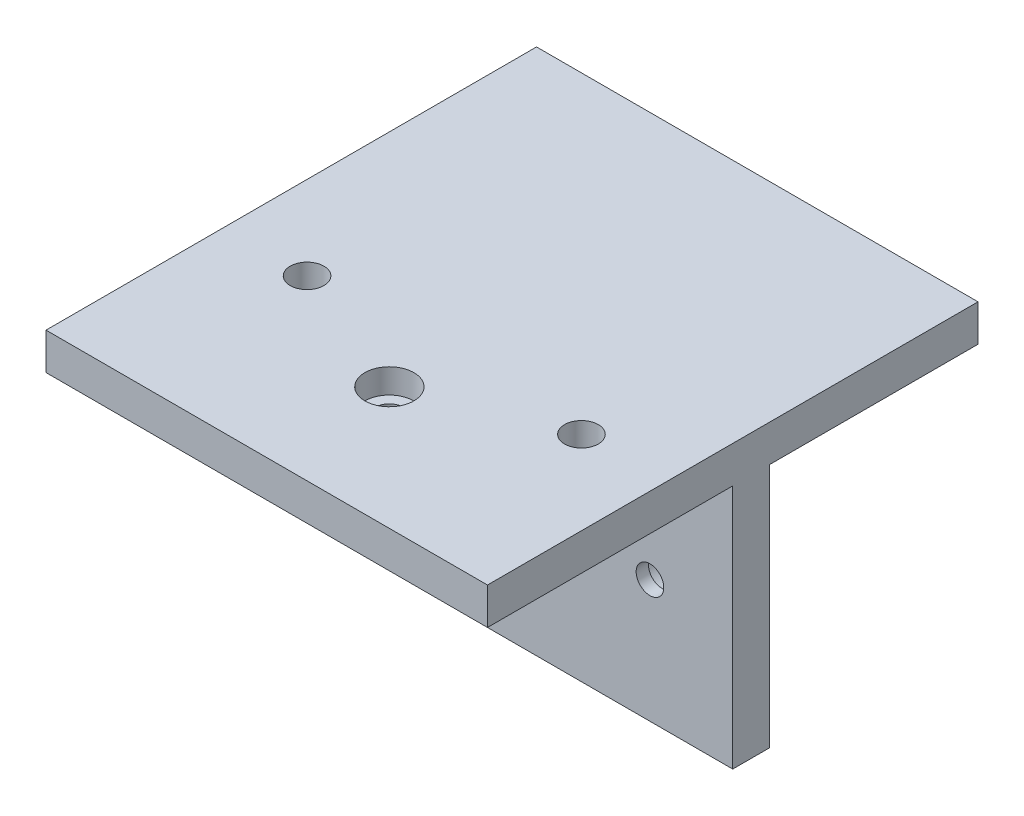
ISO-10303-21;
HEADER;
FILE_DESCRIPTION(('STEP AP214'),'2;1');
FILE_NAME('part.step','',(''),(''),'','','');
FILE_SCHEMA(('AUTOMOTIVE_DESIGN { 1 0 10303 214 1 1 1 1 }'));
ENDSEC;
DATA;
#1=APPLICATION_CONTEXT('core data for automotive mechanical design processes');
#2=APPLICATION_PROTOCOL_DEFINITION('international standard','automotive_design',2000,#1);
#3=PRODUCT_CONTEXT('',#1,'mechanical');
#4=PRODUCT('Part','Part','',(#3));
#5=PRODUCT_RELATED_PRODUCT_CATEGORY('part','',(#4));
#6=PRODUCT_DEFINITION_FORMATION('','',#4);
#7=PRODUCT_DEFINITION_CONTEXT('part definition',#1,'design');
#8=PRODUCT_DEFINITION('design','',#6,#7);
#9=PRODUCT_DEFINITION_SHAPE('','',#8);
#10=(LENGTH_UNIT() NAMED_UNIT(*) SI_UNIT(.MILLI.,.METRE.));
#11=(NAMED_UNIT(*) PLANE_ANGLE_UNIT() SI_UNIT($,.RADIAN.));
#12=(NAMED_UNIT(*) SI_UNIT($,.STERADIAN.) SOLID_ANGLE_UNIT());
#13=UNCERTAINTY_MEASURE_WITH_UNIT(LENGTH_MEASURE(1.E-05),#10,'distance_accuracy_value','');
#14=(GEOMETRIC_REPRESENTATION_CONTEXT(3) GLOBAL_UNCERTAINTY_ASSIGNED_CONTEXT((#13)) GLOBAL_UNIT_ASSIGNED_CONTEXT((#10,
#11,#12)) REPRESENTATION_CONTEXT('',''));
#15=CARTESIAN_POINT('',(0.,0.,0.));
#16=DIRECTION('',(0.,0.,1.));
#17=DIRECTION('',(1.,0.,0.));
#18=AXIS2_PLACEMENT_3D('',#15,#16,#17);
#19=CARTESIAN_POINT('',(36.,0.,-26.));
#20=DIRECTION('',(0.,0.,1.));
#21=DIRECTION('',(1.,0.,0.));
#22=AXIS2_PLACEMENT_3D('',#19,#20,#21);
#23=PLANE('',#22);
#24=CARTESIAN_POINT('',(22.5,0.,-26.));
#25=DIRECTION('',(0.,0.,-1.));
#26=DIRECTION('',(-1.,0.,0.));
#27=AXIS2_PLACEMENT_3D('',#24,#25,#26);
#28=CIRCLE('',#27,4.);
#29=CARTESIAN_POINT('',(18.5,0.,-26.));
#30=VERTEX_POINT('',#29);
#31=EDGE_CURVE('E276',#30,#30,#28,.T.);
#32=ORIENTED_EDGE('',*,*,#31,.F.);
#33=EDGE_LOOP('',(#32));
#34=FACE_BOUND('',#33,.T.);
#35=DIRECTION('',(0.,-1.,0.));
#36=VECTOR('',#35,1.);
#37=CARTESIAN_POINT('',(3.,-20.,-26.));
#38=LINE('',#37,#36);
#39=CARTESIAN_POINT('',(3.,20.,-26.));
#40=VERTEX_POINT('',#39);
#41=CARTESIAN_POINT('',(3.,-20.,-26.));
#42=VERTEX_POINT('',#41);
#43=EDGE_CURVE('E325',#40,#42,#38,.T.);
#44=ORIENTED_EDGE('',*,*,#43,.F.);
#45=DIRECTION('',(-1.,0.,0.));
#46=VECTOR('',#45,1.);
#47=CARTESIAN_POINT('',(36.,20.,-26.));
#48=LINE('',#47,#46);
#49=CARTESIAN_POINT('',(36.,20.,-26.));
#50=VERTEX_POINT('',#49);
#51=EDGE_CURVE('E210',#50,#40,#48,.T.);
#52=ORIENTED_EDGE('',*,*,#51,.F.);
#53=DIRECTION('',(0.,1.,0.));
#54=VECTOR('',#53,1.);
#55=CARTESIAN_POINT('',(36.,0.,-26.));
#56=LINE('',#55,#54);
#57=CARTESIAN_POINT('',(36.,-20.,-26.));
#58=VERTEX_POINT('',#57);
#59=EDGE_CURVE('E115',#58,#50,#56,.T.);
#60=ORIENTED_EDGE('',*,*,#59,.F.);
#61=DIRECTION('',(-1.,0.,0.));
#62=VECTOR('',#61,1.);
#63=CARTESIAN_POINT('',(36.,-20.,-26.));
#64=LINE('',#63,#62);
#65=EDGE_CURVE('E11',#58,#42,#64,.T.);
#66=ORIENTED_EDGE('',*,*,#65,.T.);
#67=EDGE_LOOP('',(#44,#52,#60,#66));
#68=FACE_BOUND('',#67,.T.);
#69=ADVANCED_FACE('F47',(#34,#68),#23,.F.);
#70=CARTESIAN_POINT('',(36.,20.,0.));
#71=DIRECTION('',(0.,1.,0.));
#72=DIRECTION('',(0.,0.,1.));
#73=AXIS2_PLACEMENT_3D('',#70,#71,#72);
#74=PLANE('',#73);
#75=DIRECTION('',(0.,0.,1.));
#76=VECTOR('',#75,1.);
#77=CARTESIAN_POINT('',(3.,20.,-26.));
#78=LINE('',#77,#76);
#79=CARTESIAN_POINT('',(3.,20.,-60.));
#80=VERTEX_POINT('',#79);
#81=EDGE_CURVE('E330',#80,#40,#78,.T.);
#82=ORIENTED_EDGE('',*,*,#81,.F.);
#83=DIRECTION('',(-1.,0.,0.));
#84=VECTOR('',#83,1.);
#85=CARTESIAN_POINT('',(36.,20.,-60.));
#86=LINE('',#85,#84);
#87=CARTESIAN_POINT('',(36.,20.,-60.));
#88=VERTEX_POINT('',#87);
#89=EDGE_CURVE('E205',#88,#80,#86,.T.);
#90=ORIENTED_EDGE('',*,*,#89,.F.);
#91=DIRECTION('',(0.,0.,-1.));
#92=VECTOR('',#91,1.);
#93=CARTESIAN_POINT('',(36.,20.,0.));
#94=LINE('',#93,#92);
#95=EDGE_CURVE('E301',#50,#88,#94,.T.);
#96=ORIENTED_EDGE('',*,*,#95,.F.);
#97=ORIENTED_EDGE('',*,*,#51,.T.);
#98=EDGE_LOOP('',(#82,#90,#96,#97));
#99=FACE_BOUND('',#98,.T.);
#100=ADVANCED_FACE('F328',(#99),#74,.F.);
#101=CARTESIAN_POINT('',(22.375,-20.001,-8.95));
#102=DIRECTION('',(0.,1.,0.));
#103=DIRECTION('',(0.,0.,1.));
#104=AXIS2_PLACEMENT_3D('',#101,#102,#103);
#105=CYLINDRICAL_SURFACE('',#104,2.25);
#106=CARTESIAN_POINT('',(22.375,20.,-8.95));
#107=DIRECTION('',(0.,1.,0.));
#108=DIRECTION('',(0.,0.,1.));
#109=AXIS2_PLACEMENT_3D('',#106,#107,#108);
#110=CIRCLE('',#109,2.25);
#111=CARTESIAN_POINT('',(22.375,20.,-6.7));
#112=VERTEX_POINT('',#111);
#113=EDGE_CURVE('E238',#112,#112,#110,.F.);
#114=ORIENTED_EDGE('',*,*,#113,.T.);
#115=EDGE_LOOP('',(#114));
#116=FACE_BOUND('',#115,.T.);
#117=CARTESIAN_POINT('',(22.375,22.,-8.95));
#118=DIRECTION('',(0.,1.,0.));
#119=DIRECTION('',(0.,0.,1.));
#120=AXIS2_PLACEMENT_3D('',#117,#118,#119);
#121=CIRCLE('',#120,2.25);
#122=CARTESIAN_POINT('',(22.375,22.,-6.7));
#123=VERTEX_POINT('',#122);
#124=EDGE_CURVE('E51',#123,#123,#121,.F.);
#125=ORIENTED_EDGE('',*,*,#124,.F.);
#126=EDGE_LOOP('',(#125));
#127=FACE_BOUND('',#126,.T.);
#128=ADVANCED_FACE('F383',(#116,#127),#105,.F.);
#129=CARTESIAN_POINT('',(-22.375,-20.001,-8.95));
#130=DIRECTION('',(0.,1.,0.));
#131=DIRECTION('',(0.,0.,1.));
#132=AXIS2_PLACEMENT_3D('',#129,#130,#131);
#133=CYLINDRICAL_SURFACE('',#132,2.25);
#134=CARTESIAN_POINT('',(-22.375,20.,-8.95));
#135=DIRECTION('',(0.,1.,0.));
#136=DIRECTION('',(0.,0.,1.));
#137=AXIS2_PLACEMENT_3D('',#134,#135,#136);
#138=CIRCLE('',#137,2.25);
#139=CARTESIAN_POINT('',(-22.375,20.,-6.7));
#140=VERTEX_POINT('',#139);
#141=EDGE_CURVE('E259',#140,#140,#138,.F.);
#142=ORIENTED_EDGE('',*,*,#141,.T.);
#143=EDGE_LOOP('',(#142));
#144=FACE_BOUND('',#143,.T.);
#145=CARTESIAN_POINT('',(-22.375,22.,-8.95));
#146=DIRECTION('',(0.,1.,0.));
#147=DIRECTION('',(0.,0.,1.));
#148=AXIS2_PLACEMENT_3D('',#145,#146,#147);
#149=CIRCLE('',#148,2.25);
#150=CARTESIAN_POINT('',(-22.375,22.,-6.7));
#151=VERTEX_POINT('',#150);
#152=EDGE_CURVE('E229',#151,#151,#149,.F.);
#153=ORIENTED_EDGE('',*,*,#152,.F.);
#154=EDGE_LOOP('',(#153));
#155=FACE_BOUND('',#154,.T.);
#156=ADVANCED_FACE('F420',(#144,#155),#133,.F.);
#157=CARTESIAN_POINT('',(0.,26.001,0.));
#158=DIRECTION('',(0.,-1.,0.));
#159=DIRECTION('',(0.,0.,-1.));
#160=AXIS2_PLACEMENT_3D('',#157,#158,#159);
#161=CYLINDRICAL_SURFACE('',#160,2.25);
#162=CARTESIAN_POINT('',(0.,20.,0.));
#163=DIRECTION('',(0.,-1.,0.));
#164=DIRECTION('',(0.,0.,-1.));
#165=AXIS2_PLACEMENT_3D('',#162,#163,#164);
#166=CIRCLE('',#165,2.25);
#167=CARTESIAN_POINT('',(0.,20.,-2.25));
#168=VERTEX_POINT('',#167);
#169=EDGE_CURVE('E223',#168,#168,#166,.T.);
#170=ORIENTED_EDGE('',*,*,#169,.T.);
#171=EDGE_LOOP('',(#170));
#172=FACE_BOUND('',#171,.T.);
#173=CARTESIAN_POINT('',(0.,22.,0.));
#174=DIRECTION('',(0.,1.,0.));
#175=DIRECTION('',(0.,0.,1.));
#176=AXIS2_PLACEMENT_3D('',#173,#174,#175);
#177=CIRCLE('',#176,2.25);
#178=CARTESIAN_POINT('',(0.,22.,2.25));
#179=VERTEX_POINT('',#178);
#180=EDGE_CURVE('E224',#179,#179,#177,.F.);
#181=ORIENTED_EDGE('',*,*,#180,.F.);
#182=EDGE_LOOP('',(#181));
#183=FACE_BOUND('',#182,.T.);
#184=ADVANCED_FACE('F417',(#172,#183),#161,.F.);
#185=CARTESIAN_POINT('',(-22.5,0.,20.001));
#186=DIRECTION('',(0.,0.,-1.));
#187=DIRECTION('',(-1.,0.,0.));
#188=AXIS2_PLACEMENT_3D('',#185,#186,#187);
#189=CYLINDRICAL_SURFACE('',#188,2.25);
#190=CARTESIAN_POINT('',(-22.5,0.,-20.));
#191=DIRECTION('',(0.,0.,-1.));
#192=DIRECTION('',(0.,1.,0.));
#193=AXIS2_PLACEMENT_3D('',#190,#191,#192);
#194=CIRCLE('',#193,2.25);
#195=CARTESIAN_POINT('',(-22.5,2.25,-20.));
#196=VERTEX_POINT('',#195);
#197=EDGE_CURVE('E290',#196,#196,#194,.F.);
#198=ORIENTED_EDGE('',*,*,#197,.T.);
#199=EDGE_LOOP('',(#198));
#200=FACE_BOUND('',#199,.T.);
#201=CARTESIAN_POINT('',(-22.5,0.,-22.));
#202=DIRECTION('',(0.,0.,-1.));
#203=DIRECTION('',(-1.,0.,0.));
#204=AXIS2_PLACEMENT_3D('',#201,#202,#203);
#205=CIRCLE('',#204,2.25);
#206=CARTESIAN_POINT('',(-24.75,0.,-22.));
#207=VERTEX_POINT('',#206);
#208=EDGE_CURVE('E218',#207,#207,#205,.F.);
#209=ORIENTED_EDGE('',*,*,#208,.F.);
#210=EDGE_LOOP('',(#209));
#211=FACE_BOUND('',#210,.T.);
#212=ADVANCED_FACE('F419',(#200,#211),#189,.F.);
#213=CARTESIAN_POINT('',(22.5,0.,20.001));
#214=DIRECTION('',(0.,0.,-1.));
#215=DIRECTION('',(-1.,0.,0.));
#216=AXIS2_PLACEMENT_3D('',#213,#214,#215);
#217=CYLINDRICAL_SURFACE('',#216,2.25);
#218=CARTESIAN_POINT('',(22.5,0.,-20.));
#219=DIRECTION('',(0.,0.,-1.));
#220=DIRECTION('',(0.,1.,0.));
#221=AXIS2_PLACEMENT_3D('',#218,#219,#220);
#222=CIRCLE('',#221,2.25);
#223=CARTESIAN_POINT('',(22.5,2.25,-20.));
#224=VERTEX_POINT('',#223);
#225=EDGE_CURVE('E171',#224,#224,#222,.F.);
#226=ORIENTED_EDGE('',*,*,#225,.T.);
#227=EDGE_LOOP('',(#226));
#228=FACE_BOUND('',#227,.T.);
#229=CARTESIAN_POINT('',(22.5,0.,-22.));
#230=DIRECTION('',(0.,0.,-1.));
#231=DIRECTION('',(-1.,0.,0.));
#232=AXIS2_PLACEMENT_3D('',#229,#230,#231);
#233=CIRCLE('',#232,2.25);
#234=CARTESIAN_POINT('',(20.25,0.,-22.));
#235=VERTEX_POINT('',#234);
#236=EDGE_CURVE('E214',#235,#235,#233,.F.);
#237=ORIENTED_EDGE('',*,*,#236,.F.);
#238=EDGE_LOOP('',(#237));
#239=FACE_BOUND('',#238,.T.);
#240=ADVANCED_FACE('F393',(#228,#239),#217,.F.);
#241=CARTESIAN_POINT('',(36.,-20.,0.));
#242=DIRECTION('',(0.,1.,0.));
#243=DIRECTION('',(0.,0.,1.));
#244=AXIS2_PLACEMENT_3D('',#241,#242,#243);
#245=PLANE('',#244);
#246=DIRECTION('',(0.,0.,-1.));
#247=VECTOR('',#246,1.);
#248=CARTESIAN_POINT('',(-36.,-20.,0.));
#249=LINE('',#248,#247);
#250=CARTESIAN_POINT('',(-36.,-20.,-20.));
#251=VERTEX_POINT('',#250);
#252=CARTESIAN_POINT('',(-36.,-20.,-26.));
#253=VERTEX_POINT('',#252);
#254=EDGE_CURVE('E166',#251,#253,#249,.T.);
#255=ORIENTED_EDGE('',*,*,#254,.T.);
#256=CARTESIAN_POINT('',(-3.,-20.,-26.));
#257=VERTEX_POINT('',#256);
#258=EDGE_CURVE('E57',#257,#253,#64,.T.);
#259=ORIENTED_EDGE('',*,*,#258,.F.);
#260=DIRECTION('',(-1.,0.,0.));
#261=VECTOR('',#260,1.);
#262=CARTESIAN_POINT('',(3.,-20.,-26.));
#263=LINE('',#262,#261);
#264=EDGE_CURVE('E249',#42,#257,#263,.T.);
#265=ORIENTED_EDGE('',*,*,#264,.F.);
#266=ORIENTED_EDGE('',*,*,#65,.F.);
#267=DIRECTION('',(0.,0.,-1.));
#268=VECTOR('',#267,1.);
#269=CARTESIAN_POINT('',(36.,-20.,0.));
#270=LINE('',#269,#268);
#271=CARTESIAN_POINT('',(36.,-20.,-20.));
#272=VERTEX_POINT('',#271);
#273=EDGE_CURVE('E194',#272,#58,#270,.T.);
#274=ORIENTED_EDGE('',*,*,#273,.F.);
#275=DIRECTION('',(-1.,0.,0.));
#276=VECTOR('',#275,1.);
#277=CARTESIAN_POINT('',(36.,-20.,-20.));
#278=LINE('',#277,#276);
#279=EDGE_CURVE('E165',#272,#251,#278,.T.);
#280=ORIENTED_EDGE('',*,*,#279,.T.);
#281=EDGE_LOOP('',(#255,#259,#265,#266,#274,#280));
#282=FACE_BOUND('',#281,.T.);
#283=ADVANCED_FACE('F49',(#282),#245,.F.);
#284=CARTESIAN_POINT('',(-22.5,0.,-26.));
#285=DIRECTION('',(0.,0.,-1.));
#286=DIRECTION('',(-1.,0.,0.));
#287=AXIS2_PLACEMENT_3D('',#284,#285,#286);
#288=CIRCLE('',#287,4.);
#289=CARTESIAN_POINT('',(-26.5,0.,-26.));
#290=VERTEX_POINT('',#289);
#291=EDGE_CURVE('E280',#290,#290,#288,.T.);
#292=ORIENTED_EDGE('',*,*,#291,.F.);
#293=EDGE_LOOP('',(#292));
#294=FACE_BOUND('',#293,.T.);
#295=CARTESIAN_POINT('',(-3.,20.,-26.));
#296=VERTEX_POINT('',#295);
#297=CARTESIAN_POINT('',(-36.,20.,-26.));
#298=VERTEX_POINT('',#297);
#299=EDGE_CURVE('E209',#296,#298,#48,.T.);
#300=ORIENTED_EDGE('',*,*,#299,.F.);
#301=DIRECTION('',(0.,-1.,0.));
#302=VECTOR('',#301,1.);
#303=CARTESIAN_POINT('',(-3.,-20.,-26.));
#304=LINE('',#303,#302);
#305=EDGE_CURVE('E344',#296,#257,#304,.T.);
#306=ORIENTED_EDGE('',*,*,#305,.T.);
#307=ORIENTED_EDGE('',*,*,#258,.T.);
#308=DIRECTION('',(0.,1.,0.));
#309=VECTOR('',#308,1.);
#310=CARTESIAN_POINT('',(-36.,0.,-26.));
#311=LINE('',#310,#309);
#312=EDGE_CURVE('E170',#253,#298,#311,.T.);
#313=ORIENTED_EDGE('',*,*,#312,.T.);
#314=EDGE_LOOP('',(#300,#306,#307,#313));
#315=FACE_BOUND('',#314,.T.);
#316=ADVANCED_FACE('F367',(#294,#315),#23,.F.);
#317=CARTESIAN_POINT('',(-3.,20.,-60.));
#318=VERTEX_POINT('',#317);
#319=CARTESIAN_POINT('',(-36.,20.,-60.));
#320=VERTEX_POINT('',#319);
#321=EDGE_CURVE('E204',#318,#320,#86,.T.);
#322=ORIENTED_EDGE('',*,*,#321,.F.);
#323=DIRECTION('',(0.,0.,1.));
#324=VECTOR('',#323,1.);
#325=CARTESIAN_POINT('',(-3.,20.,-26.));
#326=LINE('',#325,#324);
#327=EDGE_CURVE('E65',#318,#296,#326,.T.);
#328=ORIENTED_EDGE('',*,*,#327,.T.);
#329=ORIENTED_EDGE('',*,*,#299,.T.);
#330=DIRECTION('',(0.,0.,-1.));
#331=VECTOR('',#330,1.);
#332=CARTESIAN_POINT('',(-36.,20.,0.));
#333=LINE('',#332,#331);
#334=EDGE_CURVE('E175',#298,#320,#333,.T.);
#335=ORIENTED_EDGE('',*,*,#334,.T.);
#336=EDGE_LOOP('',(#322,#328,#329,#335));
#337=FACE_BOUND('',#336,.T.);
#338=ADVANCED_FACE('F385',(#337),#74,.F.);
#339=CARTESIAN_POINT('',(36.,0.,-60.));
#340=DIRECTION('',(0.,0.,-1.));
#341=DIRECTION('',(-1.,0.,0.));
#342=AXIS2_PLACEMENT_3D('',#339,#340,#341);
#343=PLANE('',#342);
#344=DIRECTION('',(0.,-1.,0.));
#345=VECTOR('',#344,1.);
#346=CARTESIAN_POINT('',(-36.,0.,-60.));
#347=LINE('',#346,#345);
#348=CARTESIAN_POINT('',(-36.,26.,-60.));
#349=VERTEX_POINT('',#348);
#350=EDGE_CURVE('E179',#349,#320,#347,.T.);
#351=ORIENTED_EDGE('',*,*,#350,.F.);
#352=DIRECTION('',(-1.,0.,0.));
#353=VECTOR('',#352,1.);
#354=CARTESIAN_POINT('',(36.,26.,-60.));
#355=LINE('',#354,#353);
#356=CARTESIAN_POINT('',(36.,26.,-60.));
#357=VERTEX_POINT('',#356);
#358=EDGE_CURVE('E201',#357,#349,#355,.T.);
#359=ORIENTED_EDGE('',*,*,#358,.F.);
#360=DIRECTION('',(0.,-1.,0.));
#361=VECTOR('',#360,1.);
#362=CARTESIAN_POINT('',(36.,0.,-60.));
#363=LINE('',#362,#361);
#364=EDGE_CURVE('E159',#357,#88,#363,.T.);
#365=ORIENTED_EDGE('',*,*,#364,.T.);
#366=ORIENTED_EDGE('',*,*,#89,.T.);
#367=DIRECTION('',(-1.,0.,0.));
#368=VECTOR('',#367,1.);
#369=CARTESIAN_POINT('',(3.,20.,-60.));
#370=LINE('',#369,#368);
#371=EDGE_CURVE('E336',#80,#318,#370,.T.);
#372=ORIENTED_EDGE('',*,*,#371,.T.);
#373=ORIENTED_EDGE('',*,*,#321,.T.);
#374=EDGE_LOOP('',(#351,#359,#365,#366,#372,#373));
#375=FACE_BOUND('',#374,.T.);
#376=ADVANCED_FACE('F307',(#375),#343,.T.);
#377=CARTESIAN_POINT('',(36.,26.,0.));
#378=DIRECTION('',(0.,1.,0.));
#379=DIRECTION('',(0.,0.,1.));
#380=AXIS2_PLACEMENT_3D('',#377,#378,#379);
#381=PLANE('',#380);
#382=CARTESIAN_POINT('',(-22.375,26.,-8.95));
#383=DIRECTION('',(0.,1.,0.));
#384=DIRECTION('',(0.,0.,1.));
#385=AXIS2_PLACEMENT_3D('',#382,#383,#384);
#386=CIRCLE('',#385,2.75);
#387=CARTESIAN_POINT('',(-22.375,26.,-6.2));
#388=VERTEX_POINT('',#387);
#389=EDGE_CURVE('E240',#388,#388,#386,.T.);
#390=ORIENTED_EDGE('',*,*,#389,.F.);
#391=EDGE_LOOP('',(#390));
#392=FACE_BOUND('',#391,.T.);
#393=CARTESIAN_POINT('',(22.375,26.,-8.95));
#394=DIRECTION('',(0.,1.,0.));
#395=DIRECTION('',(0.,0.,1.));
#396=AXIS2_PLACEMENT_3D('',#393,#394,#395);
#397=CIRCLE('',#396,2.75);
#398=CARTESIAN_POINT('',(22.375,26.,-6.2));
#399=VERTEX_POINT('',#398);
#400=EDGE_CURVE('E246',#399,#399,#397,.T.);
#401=ORIENTED_EDGE('',*,*,#400,.F.);
#402=EDGE_LOOP('',(#401));
#403=FACE_BOUND('',#402,.T.);
#404=CARTESIAN_POINT('',(0.,26.,0.));
#405=DIRECTION('',(0.,1.,0.));
#406=DIRECTION('',(0.,0.,1.));
#407=AXIS2_PLACEMENT_3D('',#404,#405,#406);
#408=CIRCLE('',#407,4.);
#409=CARTESIAN_POINT('',(0.,26.,4.));
#410=VERTEX_POINT('',#409);
#411=EDGE_CURVE('E263',#410,#410,#408,.T.);
#412=ORIENTED_EDGE('',*,*,#411,.F.);
#413=EDGE_LOOP('',(#412));
#414=FACE_BOUND('',#413,.T.);
#415=DIRECTION('',(0.,0.,-1.));
#416=VECTOR('',#415,1.);
#417=CARTESIAN_POINT('',(-36.,26.,0.));
#418=LINE('',#417,#416);
#419=CARTESIAN_POINT('',(-36.,26.,20.));
#420=VERTEX_POINT('',#419);
#421=EDGE_CURVE('E183',#420,#349,#418,.T.);
#422=ORIENTED_EDGE('',*,*,#421,.F.);
#423=DIRECTION('',(-1.,0.,0.));
#424=VECTOR('',#423,1.);
#425=CARTESIAN_POINT('',(36.,26.,20.));
#426=LINE('',#425,#424);
#427=CARTESIAN_POINT('',(36.,26.,20.));
#428=VERTEX_POINT('',#427);
#429=EDGE_CURVE('E143',#428,#420,#426,.T.);
#430=ORIENTED_EDGE('',*,*,#429,.F.);
#431=DIRECTION('',(0.,0.,-1.));
#432=VECTOR('',#431,1.);
#433=CARTESIAN_POINT('',(36.,26.,0.));
#434=LINE('',#433,#432);
#435=EDGE_CURVE('E155',#428,#357,#434,.T.);
#436=ORIENTED_EDGE('',*,*,#435,.T.);
#437=ORIENTED_EDGE('',*,*,#358,.T.);
#438=EDGE_LOOP('',(#422,#430,#436,#437));
#439=FACE_BOUND('',#438,.T.);
#440=ADVANCED_FACE('F314',(#392,#403,#414,#439),#381,.T.);
#441=CARTESIAN_POINT('',(36.,0.,20.));
#442=DIRECTION('',(0.,0.,1.));
#443=DIRECTION('',(1.,0.,0.));
#444=AXIS2_PLACEMENT_3D('',#441,#442,#443);
#445=PLANE('',#444);
#446=DIRECTION('',(0.,1.,0.));
#447=VECTOR('',#446,1.);
#448=CARTESIAN_POINT('',(-36.,0.,20.));
#449=LINE('',#448,#447);
#450=CARTESIAN_POINT('',(-36.,20.,20.));
#451=VERTEX_POINT('',#450);
#452=EDGE_CURVE('E139',#451,#420,#449,.T.);
#453=ORIENTED_EDGE('',*,*,#452,.F.);
#454=DIRECTION('',(-1.,0.,0.));
#455=VECTOR('',#454,1.);
#456=CARTESIAN_POINT('',(36.,20.,20.));
#457=LINE('',#456,#455);
#458=CARTESIAN_POINT('',(36.,20.,20.));
#459=VERTEX_POINT('',#458);
#460=EDGE_CURVE('E133',#459,#451,#457,.T.);
#461=ORIENTED_EDGE('',*,*,#460,.F.);
#462=DIRECTION('',(0.,1.,0.));
#463=VECTOR('',#462,1.);
#464=CARTESIAN_POINT('',(36.,0.,20.));
#465=LINE('',#464,#463);
#466=EDGE_CURVE('E137',#459,#428,#465,.T.);
#467=ORIENTED_EDGE('',*,*,#466,.T.);
#468=ORIENTED_EDGE('',*,*,#429,.T.);
#469=EDGE_LOOP('',(#453,#461,#467,#468));
#470=FACE_BOUND('',#469,.T.);
#471=ADVANCED_FACE('F135',(#470),#445,.T.);
#472=CARTESIAN_POINT('',(36.,20.,0.));
#473=DIRECTION('',(0.,1.,0.));
#474=DIRECTION('',(0.,0.,1.));
#475=AXIS2_PLACEMENT_3D('',#472,#473,#474);
#476=PLANE('',#475);
#477=ORIENTED_EDGE('',*,*,#141,.F.);
#478=EDGE_LOOP('',(#477));
#479=FACE_BOUND('',#478,.T.);
#480=ORIENTED_EDGE('',*,*,#113,.F.);
#481=EDGE_LOOP('',(#480));
#482=FACE_BOUND('',#481,.T.);
#483=ORIENTED_EDGE('',*,*,#169,.F.);
#484=EDGE_LOOP('',(#483));
#485=FACE_BOUND('',#484,.T.);
#486=DIRECTION('',(0.,0.,-1.));
#487=VECTOR('',#486,1.);
#488=CARTESIAN_POINT('',(-36.,20.,0.));
#489=LINE('',#488,#487);
#490=CARTESIAN_POINT('',(-36.,20.,-20.));
#491=VERTEX_POINT('',#490);
#492=EDGE_CURVE('E189',#451,#491,#489,.T.);
#493=ORIENTED_EDGE('',*,*,#492,.T.);
#494=DIRECTION('',(-1.,0.,0.));
#495=VECTOR('',#494,1.);
#496=CARTESIAN_POINT('',(36.,20.,-20.));
#497=LINE('',#496,#495);
#498=CARTESIAN_POINT('',(36.,20.,-20.));
#499=VERTEX_POINT('',#498);
#500=EDGE_CURVE('E144',#499,#491,#497,.T.);
#501=ORIENTED_EDGE('',*,*,#500,.F.);
#502=DIRECTION('',(0.,0.,-1.));
#503=VECTOR('',#502,1.);
#504=CARTESIAN_POINT('',(36.,20.,0.));
#505=LINE('',#504,#503);
#506=EDGE_CURVE('E147',#459,#499,#505,.T.);
#507=ORIENTED_EDGE('',*,*,#506,.F.);
#508=ORIENTED_EDGE('',*,*,#460,.T.);
#509=EDGE_LOOP('',(#493,#501,#507,#508));
#510=FACE_BOUND('',#509,.T.);
#511=ADVANCED_FACE('F148',(#479,#482,#485,#510),#476,.F.);
#512=CARTESIAN_POINT('',(36.,0.,-20.));
#513=DIRECTION('',(0.,0.,-1.));
#514=DIRECTION('',(0.,1.,0.));
#515=AXIS2_PLACEMENT_3D('',#512,#513,#514);
#516=PLANE('',#515);
#517=ORIENTED_EDGE('',*,*,#225,.F.);
#518=EDGE_LOOP('',(#517));
#519=FACE_BOUND('',#518,.T.);
#520=ORIENTED_EDGE('',*,*,#197,.F.);
#521=EDGE_LOOP('',(#520));
#522=FACE_BOUND('',#521,.T.);
#523=DIRECTION('',(0.,-1.,0.));
#524=VECTOR('',#523,1.);
#525=CARTESIAN_POINT('',(-36.,0.,-20.));
#526=LINE('',#525,#524);
#527=EDGE_CURVE('E107',#491,#251,#526,.T.);
#528=ORIENTED_EDGE('',*,*,#527,.T.);
#529=ORIENTED_EDGE('',*,*,#279,.F.);
#530=DIRECTION('',(0.,-1.,0.));
#531=VECTOR('',#530,1.);
#532=CARTESIAN_POINT('',(36.,0.,-20.));
#533=LINE('',#532,#531);
#534=EDGE_CURVE('E74',#499,#272,#533,.T.);
#535=ORIENTED_EDGE('',*,*,#534,.F.);
#536=ORIENTED_EDGE('',*,*,#500,.T.);
#537=EDGE_LOOP('',(#528,#529,#535,#536));
#538=FACE_BOUND('',#537,.T.);
#539=ADVANCED_FACE('F318',(#519,#522,#538),#516,.F.);
#540=CARTESIAN_POINT('',(36.,0.,0.));
#541=DIRECTION('',(1.,0.,0.));
#542=DIRECTION('',(0.,0.,-1.));
#543=AXIS2_PLACEMENT_3D('',#540,#541,#542);
#544=PLANE('',#543);
#545=ORIENTED_EDGE('',*,*,#273,.T.);
#546=ORIENTED_EDGE('',*,*,#59,.T.);
#547=ORIENTED_EDGE('',*,*,#95,.T.);
#548=ORIENTED_EDGE('',*,*,#364,.F.);
#549=ORIENTED_EDGE('',*,*,#435,.F.);
#550=ORIENTED_EDGE('',*,*,#466,.F.);
#551=ORIENTED_EDGE('',*,*,#506,.T.);
#552=ORIENTED_EDGE('',*,*,#534,.T.);
#553=EDGE_LOOP('',(#545,#546,#547,#548,#549,#550,#551,#552));
#554=FACE_BOUND('',#553,.T.);
#555=ADVANCED_FACE('F152',(#554),#544,.T.);
#556=CARTESIAN_POINT('',(-36.,0.,0.));
#557=DIRECTION('',(1.,0.,0.));
#558=DIRECTION('',(0.,0.,-1.));
#559=AXIS2_PLACEMENT_3D('',#556,#557,#558);
#560=PLANE('',#559);
#561=ORIENTED_EDGE('',*,*,#254,.F.);
#562=ORIENTED_EDGE('',*,*,#527,.F.);
#563=ORIENTED_EDGE('',*,*,#492,.F.);
#564=ORIENTED_EDGE('',*,*,#452,.T.);
#565=ORIENTED_EDGE('',*,*,#421,.T.);
#566=ORIENTED_EDGE('',*,*,#350,.T.);
#567=ORIENTED_EDGE('',*,*,#334,.F.);
#568=ORIENTED_EDGE('',*,*,#312,.F.);
#569=EDGE_LOOP('',(#561,#562,#563,#564,#565,#566,#567,#568));
#570=FACE_BOUND('',#569,.T.);
#571=ADVANCED_FACE('F317',(#570),#560,.F.);
#572=CARTESIAN_POINT('',(22.5,0.,-22.));
#573=DIRECTION('',(0.,0.,-1.));
#574=DIRECTION('',(-1.,0.,0.));
#575=AXIS2_PLACEMENT_3D('',#572,#573,#574);
#576=PLANE('',#575);
#577=CARTESIAN_POINT('',(22.5,0.,-22.));
#578=DIRECTION('',(0.,0.,-1.));
#579=DIRECTION('',(-1.,0.,0.));
#580=AXIS2_PLACEMENT_3D('',#577,#578,#579);
#581=CIRCLE('',#580,4.);
#582=CARTESIAN_POINT('',(18.5,0.,-22.));
#583=VERTEX_POINT('',#582);
#584=EDGE_CURVE('E219',#583,#583,#581,.T.);
#585=ORIENTED_EDGE('',*,*,#584,.T.);
#586=EDGE_LOOP('',(#585));
#587=FACE_BOUND('',#586,.T.);
#588=ORIENTED_EDGE('',*,*,#236,.T.);
#589=EDGE_LOOP('',(#588));
#590=FACE_BOUND('',#589,.T.);
#591=ADVANCED_FACE('F432',(#587,#590),#576,.T.);
#592=CARTESIAN_POINT('',(22.5,0.,-22.));
#593=DIRECTION('',(0.,0.,-1.));
#594=DIRECTION('',(-1.,0.,0.));
#595=AXIS2_PLACEMENT_3D('',#592,#593,#594);
#596=CYLINDRICAL_SURFACE('',#595,4.);
#597=ORIENTED_EDGE('',*,*,#584,.F.);
#598=EDGE_LOOP('',(#597));
#599=FACE_BOUND('',#598,.T.);
#600=ORIENTED_EDGE('',*,*,#31,.T.);
#601=EDGE_LOOP('',(#600));
#602=FACE_BOUND('',#601,.T.);
#603=ADVANCED_FACE('F410',(#599,#602),#596,.F.);
#604=CARTESIAN_POINT('',(-22.5,0.,-22.));
#605=DIRECTION('',(0.,0.,-1.));
#606=DIRECTION('',(-1.,0.,0.));
#607=AXIS2_PLACEMENT_3D('',#604,#605,#606);
#608=PLANE('',#607);
#609=CARTESIAN_POINT('',(-22.5,0.,-22.));
#610=DIRECTION('',(0.,0.,-1.));
#611=DIRECTION('',(-1.,0.,0.));
#612=AXIS2_PLACEMENT_3D('',#609,#610,#611);
#613=CIRCLE('',#612,4.);
#614=CARTESIAN_POINT('',(-26.5,0.,-22.));
#615=VERTEX_POINT('',#614);
#616=EDGE_CURVE('E227',#615,#615,#613,.T.);
#617=ORIENTED_EDGE('',*,*,#616,.T.);
#618=EDGE_LOOP('',(#617));
#619=FACE_BOUND('',#618,.T.);
#620=ORIENTED_EDGE('',*,*,#208,.T.);
#621=EDGE_LOOP('',(#620));
#622=FACE_BOUND('',#621,.T.);
#623=ADVANCED_FACE('F399',(#619,#622),#608,.T.);
#624=CARTESIAN_POINT('',(-22.5,0.,-22.));
#625=DIRECTION('',(0.,0.,-1.));
#626=DIRECTION('',(-1.,0.,0.));
#627=AXIS2_PLACEMENT_3D('',#624,#625,#626);
#628=CYLINDRICAL_SURFACE('',#627,4.);
#629=ORIENTED_EDGE('',*,*,#616,.F.);
#630=EDGE_LOOP('',(#629));
#631=FACE_BOUND('',#630,.T.);
#632=ORIENTED_EDGE('',*,*,#291,.T.);
#633=EDGE_LOOP('',(#632));
#634=FACE_BOUND('',#633,.T.);
#635=ADVANCED_FACE('F396',(#631,#634),#628,.F.);
#636=CARTESIAN_POINT('',(0.,22.,0.));
#637=DIRECTION('',(0.,1.,0.));
#638=DIRECTION('',(0.,0.,1.));
#639=AXIS2_PLACEMENT_3D('',#636,#637,#638);
#640=PLANE('',#639);
#641=CARTESIAN_POINT('',(0.,22.,0.));
#642=DIRECTION('',(0.,1.,0.));
#643=DIRECTION('',(0.,0.,1.));
#644=AXIS2_PLACEMENT_3D('',#641,#642,#643);
#645=CIRCLE('',#644,4.);
#646=CARTESIAN_POINT('',(0.,22.,4.));
#647=VERTEX_POINT('',#646);
#648=EDGE_CURVE('E228',#647,#647,#645,.T.);
#649=ORIENTED_EDGE('',*,*,#648,.T.);
#650=EDGE_LOOP('',(#649));
#651=FACE_BOUND('',#650,.T.);
#652=ORIENTED_EDGE('',*,*,#180,.T.);
#653=EDGE_LOOP('',(#652));
#654=FACE_BOUND('',#653,.T.);
#655=ADVANCED_FACE('F398',(#651,#654),#640,.T.);
#656=CARTESIAN_POINT('',(0.,22.,0.));
#657=DIRECTION('',(0.,1.,0.));
#658=DIRECTION('',(0.,0.,1.));
#659=AXIS2_PLACEMENT_3D('',#656,#657,#658);
#660=CYLINDRICAL_SURFACE('',#659,4.);
#661=ORIENTED_EDGE('',*,*,#648,.F.);
#662=EDGE_LOOP('',(#661));
#663=FACE_BOUND('',#662,.T.);
#664=ORIENTED_EDGE('',*,*,#411,.T.);
#665=EDGE_LOOP('',(#664));
#666=FACE_BOUND('',#665,.T.);
#667=ADVANCED_FACE('F407',(#663,#666),#660,.F.);
#668=CARTESIAN_POINT('',(-22.375,22.,-8.95));
#669=DIRECTION('',(0.,1.,0.));
#670=DIRECTION('',(0.,0.,1.));
#671=AXIS2_PLACEMENT_3D('',#668,#669,#670);
#672=PLANE('',#671);
#673=CARTESIAN_POINT('',(-22.375,22.,-8.95));
#674=DIRECTION('',(0.,1.,0.));
#675=DIRECTION('',(0.,0.,1.));
#676=AXIS2_PLACEMENT_3D('',#673,#674,#675);
#677=CIRCLE('',#676,2.75);
#678=CARTESIAN_POINT('',(-22.375,22.,-6.2));
#679=VERTEX_POINT('',#678);
#680=EDGE_CURVE('E232',#679,#679,#677,.T.);
#681=ORIENTED_EDGE('',*,*,#680,.T.);
#682=EDGE_LOOP('',(#681));
#683=FACE_BOUND('',#682,.T.);
#684=ORIENTED_EDGE('',*,*,#152,.T.);
#685=EDGE_LOOP('',(#684));
#686=FACE_BOUND('',#685,.T.);
#687=ADVANCED_FACE('F502',(#683,#686),#672,.T.);
#688=CARTESIAN_POINT('',(-22.375,22.,-8.95));
#689=DIRECTION('',(0.,1.,0.));
#690=DIRECTION('',(0.,0.,1.));
#691=AXIS2_PLACEMENT_3D('',#688,#689,#690);
#692=CYLINDRICAL_SURFACE('',#691,2.75);
#693=ORIENTED_EDGE('',*,*,#680,.F.);
#694=EDGE_LOOP('',(#693));
#695=FACE_BOUND('',#694,.T.);
#696=ORIENTED_EDGE('',*,*,#389,.T.);
#697=EDGE_LOOP('',(#696));
#698=FACE_BOUND('',#697,.T.);
#699=ADVANCED_FACE('F493',(#695,#698),#692,.F.);
#700=CARTESIAN_POINT('',(22.375,22.,-8.95));
#701=DIRECTION('',(0.,1.,0.));
#702=DIRECTION('',(0.,0.,1.));
#703=AXIS2_PLACEMENT_3D('',#700,#701,#702);
#704=PLANE('',#703);
#705=CARTESIAN_POINT('',(22.375,22.,-8.95));
#706=DIRECTION('',(0.,1.,0.));
#707=DIRECTION('',(0.,0.,1.));
#708=AXIS2_PLACEMENT_3D('',#705,#706,#707);
#709=CIRCLE('',#708,2.75);
#710=CARTESIAN_POINT('',(22.375,22.,-6.2));
#711=VERTEX_POINT('',#710);
#712=EDGE_CURVE('E255',#711,#711,#709,.T.);
#713=ORIENTED_EDGE('',*,*,#712,.T.);
#714=EDGE_LOOP('',(#713));
#715=FACE_BOUND('',#714,.T.);
#716=ORIENTED_EDGE('',*,*,#124,.T.);
#717=EDGE_LOOP('',(#716));
#718=FACE_BOUND('',#717,.T.);
#719=ADVANCED_FACE('F484',(#715,#718),#704,.T.);
#720=CARTESIAN_POINT('',(22.375,22.,-8.95));
#721=DIRECTION('',(0.,1.,0.));
#722=DIRECTION('',(0.,0.,1.));
#723=AXIS2_PLACEMENT_3D('',#720,#721,#722);
#724=CYLINDRICAL_SURFACE('',#723,2.75);
#725=ORIENTED_EDGE('',*,*,#712,.F.);
#726=EDGE_LOOP('',(#725));
#727=FACE_BOUND('',#726,.T.);
#728=ORIENTED_EDGE('',*,*,#400,.T.);
#729=EDGE_LOOP('',(#728));
#730=FACE_BOUND('',#729,.T.);
#731=ADVANCED_FACE('F456',(#727,#730),#724,.F.);
#732=CARTESIAN_POINT('',(3.,-20.,-26.));
#733=DIRECTION('',(0.,0.64764842009554,0.761939317759459));
#734=DIRECTION('',(0.,-0.761939317759459,0.64764842009554));
#735=AXIS2_PLACEMENT_3D('',#732,#733,#734);
#736=PLANE('',#735);
#737=DIRECTION('',(0.,0.76193931775946,-0.64764842009554));
#738=VECTOR('',#737,1.);
#739=CARTESIAN_POINT('',(-3.,-20.,-26.));
#740=LINE('',#739,#738);
#741=EDGE_CURVE('E348',#257,#318,#740,.T.);
#742=ORIENTED_EDGE('',*,*,#741,.T.);
#743=ORIENTED_EDGE('',*,*,#371,.F.);
#744=DIRECTION('',(0.,0.76193931775946,-0.64764842009554));
#745=VECTOR('',#744,1.);
#746=CARTESIAN_POINT('',(3.,-20.,-26.));
#747=LINE('',#746,#745);
#748=EDGE_CURVE('E337',#42,#80,#747,.T.);
#749=ORIENTED_EDGE('',*,*,#748,.F.);
#750=ORIENTED_EDGE('',*,*,#264,.T.);
#751=EDGE_LOOP('',(#742,#743,#749,#750));
#752=FACE_BOUND('',#751,.T.);
#753=ADVANCED_FACE('F365',(#752),#736,.F.);
#754=CARTESIAN_POINT('',(3.,0.,0.));
#755=DIRECTION('',(-1.,0.,0.));
#756=DIRECTION('',(0.,0.,1.));
#757=AXIS2_PLACEMENT_3D('',#754,#755,#756);
#758=PLANE('',#757);
#759=ORIENTED_EDGE('',*,*,#43,.T.);
#760=ORIENTED_EDGE('',*,*,#748,.T.);
#761=ORIENTED_EDGE('',*,*,#81,.T.);
#762=EDGE_LOOP('',(#759,#760,#761));
#763=FACE_BOUND('',#762,.T.);
#764=ADVANCED_FACE('F356',(#763),#758,.F.);
#765=CARTESIAN_POINT('',(-3.,0.,0.));
#766=DIRECTION('',(-1.,0.,0.));
#767=DIRECTION('',(0.,0.,1.));
#768=AXIS2_PLACEMENT_3D('',#765,#766,#767);
#769=PLANE('',#768);
#770=ORIENTED_EDGE('',*,*,#305,.F.);
#771=ORIENTED_EDGE('',*,*,#327,.F.);
#772=ORIENTED_EDGE('',*,*,#741,.F.);
#773=EDGE_LOOP('',(#770,#771,#772));
#774=FACE_BOUND('',#773,.T.);
#775=ADVANCED_FACE('F369',(#774),#769,.T.);
#776=CLOSED_SHELL('',(#69,#100,#128,#156,#184,#212,#240,#283,#316,#338,#376,#440,#471,#511,#539,
#555,#571,#591,#603,#623,#635,#655,#667,#687,#699,#719,#731,#753,#764,#775));
#777=MANIFOLD_SOLID_BREP('B2',#776);
#778=ADVANCED_BREP_SHAPE_REPRESENTATION('',(#18,#777),#14);
#779=SHAPE_DEFINITION_REPRESENTATION(#9,#778);
ENDSEC;
END-ISO-10303-21;
